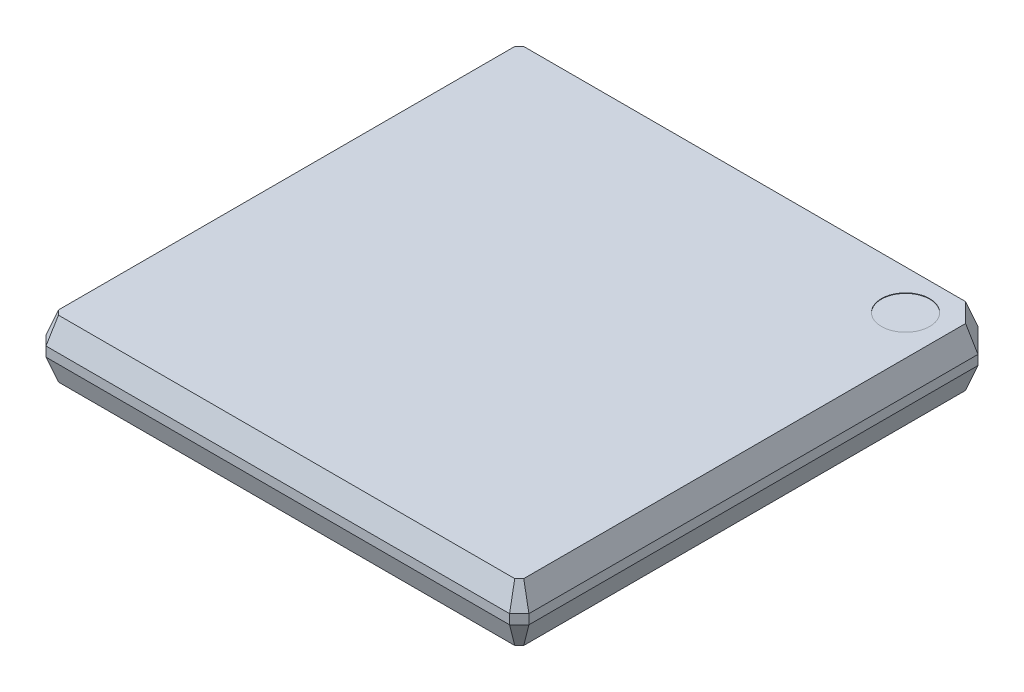
ISO-10303-21;
HEADER;
FILE_DESCRIPTION(('STEP AP214'),'2;1');
FILE_NAME('part.step','',(''),(''),'','','');
FILE_SCHEMA(('AUTOMOTIVE_DESIGN { 1 0 10303 214 1 1 1 1 }'));
ENDSEC;
DATA;
#1=APPLICATION_CONTEXT('core data for automotive mechanical design processes');
#2=APPLICATION_PROTOCOL_DEFINITION('international standard','automotive_design',2000,#1);
#3=PRODUCT_CONTEXT('',#1,'mechanical');
#4=PRODUCT('Part','Part','',(#3));
#5=PRODUCT_RELATED_PRODUCT_CATEGORY('part','',(#4));
#6=PRODUCT_DEFINITION_FORMATION('','',#4);
#7=PRODUCT_DEFINITION_CONTEXT('part definition',#1,'design');
#8=PRODUCT_DEFINITION('design','',#6,#7);
#9=PRODUCT_DEFINITION_SHAPE('','',#8);
#10=(LENGTH_UNIT() NAMED_UNIT(*) SI_UNIT(.MILLI.,.METRE.));
#11=(NAMED_UNIT(*) PLANE_ANGLE_UNIT() SI_UNIT($,.RADIAN.));
#12=(NAMED_UNIT(*) SI_UNIT($,.STERADIAN.) SOLID_ANGLE_UNIT());
#13=UNCERTAINTY_MEASURE_WITH_UNIT(LENGTH_MEASURE(1.E-05),#10,'distance_accuracy_value','');
#14=(GEOMETRIC_REPRESENTATION_CONTEXT(3) GLOBAL_UNCERTAINTY_ASSIGNED_CONTEXT((#13)) GLOBAL_UNIT_ASSIGNED_CONTEXT((#10,
#11,#12)) REPRESENTATION_CONTEXT('',''));
#15=CARTESIAN_POINT('',(0.,0.,0.));
#16=DIRECTION('',(0.,0.,1.));
#17=DIRECTION('',(1.,0.,0.));
#18=AXIS2_PLACEMENT_3D('',#15,#16,#17);
#19=CARTESIAN_POINT('',(5.,0.1,5.));
#20=DIRECTION('',(-1.,0.,0.));
#21=DIRECTION('',(0.,0.,1.));
#22=AXIS2_PLACEMENT_3D('',#19,#20,#21);
#23=PLANE('',#22);
#24=DIRECTION('',(0.,0.,-1.));
#25=VECTOR('',#24,1.);
#26=CARTESIAN_POINT('',(5.,-0.1,5.));
#27=LINE('',#26,#25);
#28=CARTESIAN_POINT('',(5.,-0.1,4.8));
#29=VERTEX_POINT('',#28);
#30=CARTESIAN_POINT('',(5.,-0.1,-4.5));
#31=VERTEX_POINT('',#30);
#32=EDGE_CURVE('E54',#29,#31,#27,.T.);
#33=ORIENTED_EDGE('',*,*,#32,.T.);
#34=DIRECTION('',(0.,1.,0.));
#35=VECTOR('',#34,1.);
#36=CARTESIAN_POINT('',(5.,0.1,-4.5));
#37=LINE('',#36,#35);
#38=CARTESIAN_POINT('',(5.,0.1,-4.5));
#39=VERTEX_POINT('',#38);
#40=EDGE_CURVE('E43',#31,#39,#37,.T.);
#41=ORIENTED_EDGE('',*,*,#40,.T.);
#42=DIRECTION('',(0.,0.,-1.));
#43=VECTOR('',#42,1.);
#44=CARTESIAN_POINT('',(5.,0.1,5.));
#45=LINE('',#44,#43);
#46=CARTESIAN_POINT('',(5.,0.1,4.8));
#47=VERTEX_POINT('',#46);
#48=EDGE_CURVE('E294',#47,#39,#45,.T.);
#49=ORIENTED_EDGE('',*,*,#48,.F.);
#50=DIRECTION('',(0.,-1.,0.));
#51=VECTOR('',#50,1.);
#52=CARTESIAN_POINT('',(5.,0.1,4.8));
#53=LINE('',#52,#51);
#54=EDGE_CURVE('E185',#47,#29,#53,.T.);
#55=ORIENTED_EDGE('',*,*,#54,.T.);
#56=EDGE_LOOP('',(#33,#41,#49,#55));
#57=FACE_BOUND('',#56,.T.);
#58=ADVANCED_FACE('F35',(#57),#23,.F.);
#59=CARTESIAN_POINT('',(-5.,0.1,-5.));
#60=DIRECTION('',(0.,0.,1.));
#61=DIRECTION('',(1.,0.,0.));
#62=AXIS2_PLACEMENT_3D('',#59,#60,#61);
#63=PLANE('',#62);
#64=DIRECTION('',(-1.,0.,0.));
#65=VECTOR('',#64,1.);
#66=CARTESIAN_POINT('',(-5.,0.1,-5.));
#67=LINE('',#66,#65);
#68=CARTESIAN_POINT('',(4.5,0.1,-5.));
#69=VERTEX_POINT('',#68);
#70=CARTESIAN_POINT('',(-4.8,0.1,-5.));
#71=VERTEX_POINT('',#70);
#72=EDGE_CURVE('E296',#69,#71,#67,.T.);
#73=ORIENTED_EDGE('',*,*,#72,.F.);
#74=DIRECTION('',(0.,-1.,0.));
#75=VECTOR('',#74,1.);
#76=CARTESIAN_POINT('',(4.5,0.1,-5.));
#77=LINE('',#76,#75);
#78=CARTESIAN_POINT('',(4.5,-0.1,-5.));
#79=VERTEX_POINT('',#78);
#80=EDGE_CURVE('E157',#69,#79,#77,.T.);
#81=ORIENTED_EDGE('',*,*,#80,.T.);
#82=DIRECTION('',(-1.,0.,0.));
#83=VECTOR('',#82,1.);
#84=CARTESIAN_POINT('',(-5.,-0.1,-5.));
#85=LINE('',#84,#83);
#86=CARTESIAN_POINT('',(-4.8,-0.1,-5.));
#87=VERTEX_POINT('',#86);
#88=EDGE_CURVE('E162',#79,#87,#85,.T.);
#89=ORIENTED_EDGE('',*,*,#88,.T.);
#90=DIRECTION('',(0.,1.,0.));
#91=VECTOR('',#90,1.);
#92=CARTESIAN_POINT('',(-4.8,0.1,-5.));
#93=LINE('',#92,#91);
#94=EDGE_CURVE('E146',#87,#71,#93,.T.);
#95=ORIENTED_EDGE('',*,*,#94,.T.);
#96=EDGE_LOOP('',(#73,#81,#89,#95));
#97=FACE_BOUND('',#96,.T.);
#98=ADVANCED_FACE('F164',(#97),#63,.F.);
#99=CARTESIAN_POINT('',(-5.,0.1,5.));
#100=DIRECTION('',(1.,0.,0.));
#101=DIRECTION('',(0.,0.,-1.));
#102=AXIS2_PLACEMENT_3D('',#99,#100,#101);
#103=PLANE('',#102);
#104=DIRECTION('',(0.,0.,1.));
#105=VECTOR('',#104,1.);
#106=CARTESIAN_POINT('',(-5.,-0.1,5.));
#107=LINE('',#106,#105);
#108=CARTESIAN_POINT('',(-5.,-0.1,-4.8));
#109=VERTEX_POINT('',#108);
#110=CARTESIAN_POINT('',(-5.,-0.1,4.8));
#111=VERTEX_POINT('',#110);
#112=EDGE_CURVE('E168',#109,#111,#107,.T.);
#113=ORIENTED_EDGE('',*,*,#112,.T.);
#114=DIRECTION('',(0.,1.,0.));
#115=VECTOR('',#114,1.);
#116=CARTESIAN_POINT('',(-5.,0.1,4.8));
#117=LINE('',#116,#115);
#118=CARTESIAN_POINT('',(-5.,0.1,4.8));
#119=VERTEX_POINT('',#118);
#120=EDGE_CURVE('E158',#111,#119,#117,.T.);
#121=ORIENTED_EDGE('',*,*,#120,.T.);
#122=DIRECTION('',(0.,0.,1.));
#123=VECTOR('',#122,1.);
#124=CARTESIAN_POINT('',(-5.,0.1,5.));
#125=LINE('',#124,#123);
#126=CARTESIAN_POINT('',(-5.,0.1,-4.8));
#127=VERTEX_POINT('',#126);
#128=EDGE_CURVE('E300',#127,#119,#125,.T.);
#129=ORIENTED_EDGE('',*,*,#128,.F.);
#130=DIRECTION('',(0.,-1.,0.));
#131=VECTOR('',#130,1.);
#132=CARTESIAN_POINT('',(-5.,0.1,-4.8));
#133=LINE('',#132,#131);
#134=EDGE_CURVE('E208',#127,#109,#133,.T.);
#135=ORIENTED_EDGE('',*,*,#134,.T.);
#136=EDGE_LOOP('',(#113,#121,#129,#135));
#137=FACE_BOUND('',#136,.T.);
#138=ADVANCED_FACE('F341',(#137),#103,.F.);
#139=CARTESIAN_POINT('',(-5.,0.1,5.));
#140=DIRECTION('',(0.,0.,-1.));
#141=DIRECTION('',(-1.,0.,0.));
#142=AXIS2_PLACEMENT_3D('',#139,#140,#141);
#143=PLANE('',#142);
#144=DIRECTION('',(1.,0.,0.));
#145=VECTOR('',#144,1.);
#146=CARTESIAN_POINT('',(-5.,-0.1,5.));
#147=LINE('',#146,#145);
#148=CARTESIAN_POINT('',(-4.8,-0.1,5.));
#149=VERTEX_POINT('',#148);
#150=CARTESIAN_POINT('',(4.8,-0.1,5.));
#151=VERTEX_POINT('',#150);
#152=EDGE_CURVE('E297',#149,#151,#147,.T.);
#153=ORIENTED_EDGE('',*,*,#152,.T.);
#154=DIRECTION('',(0.,1.,0.));
#155=VECTOR('',#154,1.);
#156=CARTESIAN_POINT('',(4.8,0.1,5.));
#157=LINE('',#156,#155);
#158=CARTESIAN_POINT('',(4.8,0.1,5.));
#159=VERTEX_POINT('',#158);
#160=EDGE_CURVE('E199',#151,#159,#157,.T.);
#161=ORIENTED_EDGE('',*,*,#160,.T.);
#162=DIRECTION('',(1.,0.,0.));
#163=VECTOR('',#162,1.);
#164=CARTESIAN_POINT('',(-5.,0.1,5.));
#165=LINE('',#164,#163);
#166=CARTESIAN_POINT('',(-4.8,0.1,5.));
#167=VERTEX_POINT('',#166);
#168=EDGE_CURVE('E190',#167,#159,#165,.T.);
#169=ORIENTED_EDGE('',*,*,#168,.F.);
#170=DIRECTION('',(0.,-1.,0.));
#171=VECTOR('',#170,1.);
#172=CARTESIAN_POINT('',(-4.8,0.1,5.));
#173=LINE('',#172,#171);
#174=EDGE_CURVE('E196',#167,#149,#173,.T.);
#175=ORIENTED_EDGE('',*,*,#174,.T.);
#176=EDGE_LOOP('',(#153,#161,#169,#175));
#177=FACE_BOUND('',#176,.T.);
#178=ADVANCED_FACE('F309',(#177),#143,.F.);
#179=CARTESIAN_POINT('',(5.,0.1,4.8));
#180=DIRECTION('',(-0.707106781186548,0.,-0.707106781186548));
#181=DIRECTION('',(0.,-1.,0.));
#182=AXIS2_PLACEMENT_3D('',#179,#180,#181);
#183=PLANE('',#182);
#184=DIRECTION('',(-0.707106781186548,0.,0.707106781186548));
#185=VECTOR('',#184,1.);
#186=CARTESIAN_POINT('',(5.,0.1,4.8));
#187=LINE('',#186,#185);
#188=EDGE_CURVE('E205',#159,#47,#187,.F.);
#189=ORIENTED_EDGE('',*,*,#188,.F.);
#190=ORIENTED_EDGE('',*,*,#160,.F.);
#191=DIRECTION('',(0.707106781186548,0.,-0.707106781186548));
#192=VECTOR('',#191,1.);
#193=CARTESIAN_POINT('',(4.9,-0.1,4.9));
#194=LINE('',#193,#192);
#195=EDGE_CURVE('E188',#29,#151,#194,.F.);
#196=ORIENTED_EDGE('',*,*,#195,.F.);
#197=ORIENTED_EDGE('',*,*,#54,.F.);
#198=EDGE_LOOP('',(#189,#190,#196,#197));
#199=FACE_BOUND('',#198,.T.);
#200=ADVANCED_FACE('F316',(#199),#183,.F.);
#201=CARTESIAN_POINT('',(-4.8,0.1,5.));
#202=DIRECTION('',(0.707106781186548,0.,-0.707106781186548));
#203=DIRECTION('',(0.,-1.,0.));
#204=AXIS2_PLACEMENT_3D('',#201,#202,#203);
#205=PLANE('',#204);
#206=DIRECTION('',(-0.707106781186548,0.,-0.707106781186548));
#207=VECTOR('',#206,1.);
#208=CARTESIAN_POINT('',(-4.8,0.1,5.));
#209=LINE('',#208,#207);
#210=EDGE_CURVE('E202',#119,#167,#209,.F.);
#211=ORIENTED_EDGE('',*,*,#210,.F.);
#212=ORIENTED_EDGE('',*,*,#120,.F.);
#213=DIRECTION('',(0.707106781186548,0.,0.707106781186548));
#214=VECTOR('',#213,1.);
#215=CARTESIAN_POINT('',(-4.9,-0.1,4.9));
#216=LINE('',#215,#214);
#217=EDGE_CURVE('E184',#149,#111,#216,.F.);
#218=ORIENTED_EDGE('',*,*,#217,.F.);
#219=ORIENTED_EDGE('',*,*,#174,.F.);
#220=EDGE_LOOP('',(#211,#212,#218,#219));
#221=FACE_BOUND('',#220,.T.);
#222=ADVANCED_FACE('F339',(#221),#205,.F.);
#223=CARTESIAN_POINT('',(-5.,0.1,-4.8));
#224=DIRECTION('',(0.707106781186548,0.,0.707106781186548));
#225=DIRECTION('',(0.,-1.,0.));
#226=AXIS2_PLACEMENT_3D('',#223,#224,#225);
#227=PLANE('',#226);
#228=DIRECTION('',(0.707106781186548,0.,-0.707106781186548));
#229=VECTOR('',#228,1.);
#230=CARTESIAN_POINT('',(-5.,0.1,-4.8));
#231=LINE('',#230,#229);
#232=EDGE_CURVE('E154',#71,#127,#231,.F.);
#233=ORIENTED_EDGE('',*,*,#232,.F.);
#234=ORIENTED_EDGE('',*,*,#94,.F.);
#235=DIRECTION('',(-0.707106781186548,0.,0.707106781186548));
#236=VECTOR('',#235,1.);
#237=CARTESIAN_POINT('',(-4.9,-0.1,-4.9));
#238=LINE('',#237,#236);
#239=EDGE_CURVE('E151',#109,#87,#238,.F.);
#240=ORIENTED_EDGE('',*,*,#239,.F.);
#241=ORIENTED_EDGE('',*,*,#134,.F.);
#242=EDGE_LOOP('',(#233,#234,#240,#241));
#243=FACE_BOUND('',#242,.T.);
#244=ADVANCED_FACE('F148',(#243),#227,.F.);
#245=CARTESIAN_POINT('',(4.5,0.1,-5.));
#246=DIRECTION('',(-0.707106781186549,0.,0.707106781186546));
#247=DIRECTION('',(0.,-1.,0.));
#248=AXIS2_PLACEMENT_3D('',#245,#246,#247);
#249=PLANE('',#248);
#250=DIRECTION('',(0.707106781186546,0.,0.707106781186549));
#251=VECTOR('',#250,1.);
#252=CARTESIAN_POINT('',(4.5,0.1,-5.));
#253=LINE('',#252,#251);
#254=EDGE_CURVE('E11',#39,#69,#253,.F.);
#255=ORIENTED_EDGE('',*,*,#254,.F.);
#256=ORIENTED_EDGE('',*,*,#40,.F.);
#257=DIRECTION('',(-0.707106781186546,0.,-0.707106781186549));
#258=VECTOR('',#257,1.);
#259=CARTESIAN_POINT('',(4.75000000000001,-0.1,-4.74999999999999));
#260=LINE('',#259,#258);
#261=EDGE_CURVE('E212',#79,#31,#260,.F.);
#262=ORIENTED_EDGE('',*,*,#261,.F.);
#263=ORIENTED_EDGE('',*,*,#80,.F.);
#264=EDGE_LOOP('',(#255,#256,#262,#263));
#265=FACE_BOUND('',#264,.T.);
#266=ADVANCED_FACE('F37',(#265),#249,.F.);
#267=CARTESIAN_POINT('',(4.5,0.1,-5.));
#268=DIRECTION('',(0.,0.342020143325669,-0.939692620785908));
#269=DIRECTION('',(0.,0.939692620785908,0.342020143325669));
#270=AXIS2_PLACEMENT_3D('',#267,#268,#269);
#271=PLANE('',#270);
#272=ORIENTED_EDGE('',*,*,#72,.T.);
#273=DIRECTION('',(-0.140268762712281,-0.930402317101582,-0.338638749317281));
#274=VECTOR('',#273,1.);
#275=CARTESIAN_POINT('',(-4.8,0.1,-5.));
#276=LINE('',#275,#274);
#277=CARTESIAN_POINT('',(-4.72461929633342,0.6,-4.8180148828669));
#278=VERTEX_POINT('',#277);
#279=EDGE_CURVE('E255',#278,#71,#276,.T.);
#280=ORIENTED_EDGE('',*,*,#279,.F.);
#281=DIRECTION('',(1.,0.,0.));
#282=VECTOR('',#281,1.);
#283=CARTESIAN_POINT('',(4.5,0.6,-4.8180148828669));
#284=LINE('',#283,#282);
#285=CARTESIAN_POINT('',(4.42461929633341,0.6,-4.8180148828669));
#286=VERTEX_POINT('',#285);
#287=EDGE_CURVE('E230',#286,#278,#284,.F.);
#288=ORIENTED_EDGE('',*,*,#287,.F.);
#289=DIRECTION('',(0.140268762712281,-0.930402317101582,-0.338638749317281));
#290=VECTOR('',#289,1.);
#291=CARTESIAN_POINT('',(4.5,0.1,-5.));
#292=LINE('',#291,#290);
#293=EDGE_CURVE('E258',#286,#69,#292,.T.);
#294=ORIENTED_EDGE('',*,*,#293,.T.);
#295=EDGE_LOOP('',(#272,#280,#288,#294));
#296=FACE_BOUND('',#295,.T.);
#297=ADVANCED_FACE('F358',(#296),#271,.T.);
#298=CARTESIAN_POINT('',(-4.8,0.1,-5.));
#299=DIRECTION('',(-0.664463024388675,0.342020143325669,-0.664463024388675));
#300=DIRECTION('',(-0.707106781186547,0.,0.707106781186547));
#301=AXIS2_PLACEMENT_3D('',#298,#299,#300);
#302=PLANE('',#301);
#303=ORIENTED_EDGE('',*,*,#232,.T.);
#304=DIRECTION('',(-0.338638749317281,-0.930402317101582,-0.140268762712281));
#305=VECTOR('',#304,1.);
#306=CARTESIAN_POINT('',(-5.,0.1,-4.8));
#307=LINE('',#306,#305);
#308=CARTESIAN_POINT('',(-4.8180148828669,0.6,-4.72461929633342));
#309=VERTEX_POINT('',#308);
#310=EDGE_CURVE('E257',#309,#127,#307,.T.);
#311=ORIENTED_EDGE('',*,*,#310,.F.);
#312=DIRECTION('',(0.707106781186547,0.,-0.707106781186547));
#313=VECTOR('',#312,1.);
#314=CARTESIAN_POINT('',(-4.67131708960016,0.6,-4.87131708960016));
#315=LINE('',#314,#313);
#316=EDGE_CURVE('E281',#278,#309,#315,.F.);
#317=ORIENTED_EDGE('',*,*,#316,.F.);
#318=ORIENTED_EDGE('',*,*,#279,.T.);
#319=EDGE_LOOP('',(#303,#311,#317,#318));
#320=FACE_BOUND('',#319,.T.);
#321=ADVANCED_FACE('F344',(#320),#302,.T.);
#322=CARTESIAN_POINT('',(-5.,0.1,-4.8));
#323=DIRECTION('',(-0.939692620785908,0.342020143325669,0.));
#324=DIRECTION('',(-0.342020143325669,-0.939692620785908,0.));
#325=AXIS2_PLACEMENT_3D('',#322,#323,#324);
#326=PLANE('',#325);
#327=ORIENTED_EDGE('',*,*,#128,.T.);
#328=DIRECTION('',(-0.338638749317281,-0.930402317101582,0.140268762712281));
#329=VECTOR('',#328,1.);
#330=CARTESIAN_POINT('',(-5.,0.1,4.8));
#331=LINE('',#330,#329);
#332=CARTESIAN_POINT('',(-4.8180148828669,0.6,4.72461929633341));
#333=VERTEX_POINT('',#332);
#334=EDGE_CURVE('E274',#333,#119,#331,.T.);
#335=ORIENTED_EDGE('',*,*,#334,.F.);
#336=DIRECTION('',(0.,0.,-1.));
#337=VECTOR('',#336,1.);
#338=CARTESIAN_POINT('',(-4.8180148828669,0.6,-4.8));
#339=LINE('',#338,#337);
#340=EDGE_CURVE('E283',#309,#333,#339,.F.);
#341=ORIENTED_EDGE('',*,*,#340,.F.);
#342=ORIENTED_EDGE('',*,*,#310,.T.);
#343=EDGE_LOOP('',(#327,#335,#341,#342));
#344=FACE_BOUND('',#343,.T.);
#345=ADVANCED_FACE('F348',(#344),#326,.T.);
#346=CARTESIAN_POINT('',(-5.,0.1,4.8));
#347=DIRECTION('',(-0.664463024388675,0.342020143325669,0.664463024388675));
#348=DIRECTION('',(0.707106781186547,0.,0.707106781186547));
#349=AXIS2_PLACEMENT_3D('',#346,#347,#348);
#350=PLANE('',#349);
#351=ORIENTED_EDGE('',*,*,#210,.T.);
#352=DIRECTION('',(-0.140268762712281,-0.930402317101582,0.338638749317281));
#353=VECTOR('',#352,1.);
#354=CARTESIAN_POINT('',(-4.8,0.1,5.));
#355=LINE('',#354,#353);
#356=CARTESIAN_POINT('',(-4.72461929633341,0.6,4.8180148828669));
#357=VERTEX_POINT('',#356);
#358=EDGE_CURVE('E271',#357,#167,#355,.T.);
#359=ORIENTED_EDGE('',*,*,#358,.F.);
#360=DIRECTION('',(-0.707106781186547,0.,-0.707106781186547));
#361=VECTOR('',#360,1.);
#362=CARTESIAN_POINT('',(-4.87131708960015,0.6,4.67131708960016));
#363=LINE('',#362,#361);
#364=EDGE_CURVE('E285',#333,#357,#363,.F.);
#365=ORIENTED_EDGE('',*,*,#364,.F.);
#366=ORIENTED_EDGE('',*,*,#334,.T.);
#367=EDGE_LOOP('',(#351,#359,#365,#366));
#368=FACE_BOUND('',#367,.T.);
#369=ADVANCED_FACE('F374',(#368),#350,.T.);
#370=CARTESIAN_POINT('',(-4.8,0.1,5.));
#371=DIRECTION('',(0.,0.342020143325669,0.939692620785908));
#372=DIRECTION('',(0.,-0.939692620785908,0.342020143325669));
#373=AXIS2_PLACEMENT_3D('',#370,#371,#372);
#374=PLANE('',#373);
#375=ORIENTED_EDGE('',*,*,#168,.T.);
#376=DIRECTION('',(0.140268762712281,-0.930402317101582,0.338638749317281));
#377=VECTOR('',#376,1.);
#378=CARTESIAN_POINT('',(4.8,0.1,5.));
#379=LINE('',#378,#377);
#380=CARTESIAN_POINT('',(4.72461929633342,0.6,4.8180148828669));
#381=VERTEX_POINT('',#380);
#382=EDGE_CURVE('E268',#381,#159,#379,.T.);
#383=ORIENTED_EDGE('',*,*,#382,.F.);
#384=DIRECTION('',(-1.,0.,0.));
#385=VECTOR('',#384,1.);
#386=CARTESIAN_POINT('',(-4.8,0.6,4.8180148828669));
#387=LINE('',#386,#385);
#388=EDGE_CURVE('E287',#357,#381,#387,.F.);
#389=ORIENTED_EDGE('',*,*,#388,.F.);
#390=ORIENTED_EDGE('',*,*,#358,.T.);
#391=EDGE_LOOP('',(#375,#383,#389,#390));
#392=FACE_BOUND('',#391,.T.);
#393=ADVANCED_FACE('F372',(#392),#374,.T.);
#394=CARTESIAN_POINT('',(4.8,0.1,5.));
#395=DIRECTION('',(0.664463024388675,0.342020143325669,0.664463024388675));
#396=DIRECTION('',(0.707106781186547,0.,-0.707106781186547));
#397=AXIS2_PLACEMENT_3D('',#394,#395,#396);
#398=PLANE('',#397);
#399=ORIENTED_EDGE('',*,*,#188,.T.);
#400=DIRECTION('',(0.338638749317281,-0.930402317101582,0.140268762712281));
#401=VECTOR('',#400,1.);
#402=CARTESIAN_POINT('',(5.,0.1,4.8));
#403=LINE('',#402,#401);
#404=CARTESIAN_POINT('',(4.8180148828669,0.6,4.72461929633341));
#405=VERTEX_POINT('',#404);
#406=EDGE_CURVE('E265',#405,#47,#403,.T.);
#407=ORIENTED_EDGE('',*,*,#406,.F.);
#408=DIRECTION('',(-0.707106781186547,0.,0.707106781186547));
#409=VECTOR('',#408,1.);
#410=CARTESIAN_POINT('',(4.67131708960016,0.6,4.87131708960015));
#411=LINE('',#410,#409);
#412=EDGE_CURVE('E289',#381,#405,#411,.F.);
#413=ORIENTED_EDGE('',*,*,#412,.F.);
#414=ORIENTED_EDGE('',*,*,#382,.T.);
#415=EDGE_LOOP('',(#399,#407,#413,#414));
#416=FACE_BOUND('',#415,.T.);
#417=ADVANCED_FACE('F367',(#416),#398,.T.);
#418=CARTESIAN_POINT('',(5.,0.1,4.8));
#419=DIRECTION('',(0.939692620785908,0.342020143325669,0.));
#420=DIRECTION('',(-0.342020143325669,0.939692620785908,0.));
#421=AXIS2_PLACEMENT_3D('',#418,#419,#420);
#422=PLANE('',#421);
#423=ORIENTED_EDGE('',*,*,#48,.T.);
#424=DIRECTION('',(0.338638749317281,-0.930402317101582,-0.14026876271228));
#425=VECTOR('',#424,1.);
#426=CARTESIAN_POINT('',(5.,0.1,-4.5));
#427=LINE('',#426,#425);
#428=CARTESIAN_POINT('',(4.8180148828669,0.6,-4.42461929633341));
#429=VERTEX_POINT('',#428);
#430=EDGE_CURVE('E261',#429,#39,#427,.T.);
#431=ORIENTED_EDGE('',*,*,#430,.F.);
#432=DIRECTION('',(0.,0.,1.));
#433=VECTOR('',#432,1.);
#434=CARTESIAN_POINT('',(4.8180148828669,0.6,4.8));
#435=LINE('',#434,#433);
#436=EDGE_CURVE('E291',#405,#429,#435,.F.);
#437=ORIENTED_EDGE('',*,*,#436,.F.);
#438=ORIENTED_EDGE('',*,*,#406,.T.);
#439=EDGE_LOOP('',(#423,#431,#437,#438));
#440=FACE_BOUND('',#439,.T.);
#441=ADVANCED_FACE('F364',(#440),#422,.T.);
#442=CARTESIAN_POINT('',(5.,0.1,-4.5));
#443=DIRECTION('',(0.664463024388676,0.342020143325669,-0.664463024388673));
#444=DIRECTION('',(-0.707106781186546,0.,-0.707106781186549));
#445=AXIS2_PLACEMENT_3D('',#442,#443,#444);
#446=PLANE('',#445);
#447=ORIENTED_EDGE('',*,*,#254,.T.);
#448=ORIENTED_EDGE('',*,*,#293,.F.);
#449=DIRECTION('',(0.707106781186546,0.,0.707106781186549));
#450=VECTOR('',#449,1.);
#451=CARTESIAN_POINT('',(4.87131708960016,0.6,-4.37131708960016));
#452=LINE('',#451,#450);
#453=EDGE_CURVE('E262',#429,#286,#452,.F.);
#454=ORIENTED_EDGE('',*,*,#453,.F.);
#455=ORIENTED_EDGE('',*,*,#430,.T.);
#456=EDGE_LOOP('',(#447,#448,#454,#455));
#457=FACE_BOUND('',#456,.T.);
#458=ADVANCED_FACE('F360',(#457),#446,.T.);
#459=CARTESIAN_POINT('',(0.,0.6,0.));
#460=DIRECTION('',(0.,1.,0.));
#461=DIRECTION('',(0.,0.,1.));
#462=AXIS2_PLACEMENT_3D('',#459,#460,#461);
#463=PLANE('',#462);
#464=CARTESIAN_POINT('',(4.,0.6,-4.));
#465=DIRECTION('',(0.,1.,0.));
#466=DIRECTION('',(0.,0.,1.));
#467=AXIS2_PLACEMENT_3D('',#464,#465,#466);
#468=CIRCLE('',#467,0.500000000000001);
#469=CARTESIAN_POINT('',(4.,0.6,-3.5));
#470=VERTEX_POINT('',#469);
#471=EDGE_CURVE('E606',#470,#470,#468,.T.);
#472=ORIENTED_EDGE('',*,*,#471,.F.);
#473=EDGE_LOOP('',(#472));
#474=FACE_BOUND('',#473,.T.);
#475=ORIENTED_EDGE('',*,*,#287,.T.);
#476=ORIENTED_EDGE('',*,*,#316,.T.);
#477=ORIENTED_EDGE('',*,*,#340,.T.);
#478=ORIENTED_EDGE('',*,*,#364,.T.);
#479=ORIENTED_EDGE('',*,*,#388,.T.);
#480=ORIENTED_EDGE('',*,*,#412,.T.);
#481=ORIENTED_EDGE('',*,*,#436,.T.);
#482=ORIENTED_EDGE('',*,*,#453,.T.);
#483=EDGE_LOOP('',(#475,#476,#477,#478,#479,#480,#481,#482));
#484=FACE_BOUND('',#483,.T.);
#485=ADVANCED_FACE('F352',(#474,#484),#463,.T.);
#486=CARTESIAN_POINT('',(4.5,-0.1,-5.));
#487=DIRECTION('',(0.,-0.342020143325669,-0.939692620785908));
#488=DIRECTION('',(0.,0.939692620785908,-0.342020143325669));
#489=AXIS2_PLACEMENT_3D('',#486,#487,#488);
#490=PLANE('',#489);
#491=ORIENTED_EDGE('',*,*,#88,.F.);
#492=DIRECTION('',(0.140268762712281,0.930402317101582,-0.338638749317281));
#493=VECTOR('',#492,1.);
#494=CARTESIAN_POINT('',(4.48608744370983,-0.192281947590352,-4.966412117917));
#495=LINE('',#494,#493);
#496=CARTESIAN_POINT('',(4.42461929633341,-0.6,-4.8180148828669));
#497=VERTEX_POINT('',#496);
#498=EDGE_CURVE('E220',#497,#79,#495,.T.);
#499=ORIENTED_EDGE('',*,*,#498,.F.);
#500=DIRECTION('',(-1.,0.,0.));
#501=VECTOR('',#500,1.);
#502=CARTESIAN_POINT('',(4.5,-0.6,-4.8180148828669));
#503=LINE('',#502,#501);
#504=CARTESIAN_POINT('',(-4.72461929633342,-0.6,-4.8180148828669));
#505=VERTEX_POINT('',#504);
#506=EDGE_CURVE('E174',#497,#505,#503,.T.);
#507=ORIENTED_EDGE('',*,*,#506,.T.);
#508=DIRECTION('',(-0.140268762712281,0.930402317101582,-0.338638749317281));
#509=VECTOR('',#508,1.);
#510=CARTESIAN_POINT('',(-4.61701947012665,-1.31370935115364,-4.55824592312953));
#511=LINE('',#510,#509);
#512=EDGE_CURVE('E171',#505,#87,#511,.T.);
#513=ORIENTED_EDGE('',*,*,#512,.T.);
#514=EDGE_LOOP('',(#491,#499,#507,#513));
#515=FACE_BOUND('',#514,.T.);
#516=ADVANCED_FACE('F172',(#515),#490,.T.);
#517=CARTESIAN_POINT('',(5.,-0.1,-4.5));
#518=DIRECTION('',(0.664463024388676,-0.342020143325669,-0.664463024388673));
#519=DIRECTION('',(-0.707106781186546,0.,-0.707106781186549));
#520=AXIS2_PLACEMENT_3D('',#517,#518,#519);
#521=PLANE('',#520);
#522=ORIENTED_EDGE('',*,*,#261,.T.);
#523=DIRECTION('',(0.338638749317281,0.930402317101582,-0.14026876271228));
#524=VECTOR('',#523,1.);
#525=CARTESIAN_POINT('',(4.55824592312953,-1.31370935115364,-4.31701947012664));
#526=LINE('',#525,#524);
#527=CARTESIAN_POINT('',(4.8180148828669,-0.6,-4.42461929633341));
#528=VERTEX_POINT('',#527);
#529=EDGE_CURVE('E218',#528,#31,#526,.T.);
#530=ORIENTED_EDGE('',*,*,#529,.F.);
#531=DIRECTION('',(-0.707106781186546,0.,-0.707106781186549));
#532=VECTOR('',#531,1.);
#533=CARTESIAN_POINT('',(4.87131708960016,-0.6,-4.37131708960016));
#534=LINE('',#533,#532);
#535=EDGE_CURVE('E238',#528,#497,#534,.T.);
#536=ORIENTED_EDGE('',*,*,#535,.T.);
#537=ORIENTED_EDGE('',*,*,#498,.T.);
#538=EDGE_LOOP('',(#522,#530,#536,#537));
#539=FACE_BOUND('',#538,.T.);
#540=ADVANCED_FACE('F215',(#539),#521,.T.);
#541=CARTESIAN_POINT('',(5.,-0.1,4.8));
#542=DIRECTION('',(0.939692620785908,-0.342020143325669,0.));
#543=DIRECTION('',(0.342020143325669,0.939692620785908,0.));
#544=AXIS2_PLACEMENT_3D('',#541,#542,#543);
#545=PLANE('',#544);
#546=ORIENTED_EDGE('',*,*,#32,.F.);
#547=DIRECTION('',(0.338638749317281,0.930402317101582,0.140268762712281));
#548=VECTOR('',#547,1.);
#549=CARTESIAN_POINT('',(4.9865648471668,-0.13691277903614,4.79443497748393));
#550=LINE('',#549,#548);
#551=CARTESIAN_POINT('',(4.8180148828669,-0.6,4.72461929633341));
#552=VERTEX_POINT('',#551);
#553=EDGE_CURVE('E228',#552,#29,#550,.T.);
#554=ORIENTED_EDGE('',*,*,#553,.F.);
#555=DIRECTION('',(0.,0.,-1.));
#556=VECTOR('',#555,1.);
#557=CARTESIAN_POINT('',(4.8180148828669,-0.6,4.8));
#558=LINE('',#557,#556);
#559=EDGE_CURVE('E227',#552,#528,#558,.T.);
#560=ORIENTED_EDGE('',*,*,#559,.T.);
#561=ORIENTED_EDGE('',*,*,#529,.T.);
#562=EDGE_LOOP('',(#546,#554,#560,#561));
#563=FACE_BOUND('',#562,.T.);
#564=ADVANCED_FACE('F225',(#563),#545,.T.);
#565=CARTESIAN_POINT('',(4.8,-0.1,5.));
#566=DIRECTION('',(0.664463024388675,-0.342020143325669,0.664463024388675));
#567=DIRECTION('',(0.707106781186547,0.,-0.707106781186547));
#568=AXIS2_PLACEMENT_3D('',#565,#566,#567);
#569=PLANE('',#568);
#570=ORIENTED_EDGE('',*,*,#195,.T.);
#571=DIRECTION('',(0.140268762712281,0.930402317101582,0.338638749317281));
#572=VECTOR('',#571,1.);
#573=CARTESIAN_POINT('',(4.61111687238879,-1.35286126570699,4.54399579161757));
#574=LINE('',#573,#572);
#575=CARTESIAN_POINT('',(4.72461929633342,-0.6,4.8180148828669));
#576=VERTEX_POINT('',#575);
#577=EDGE_CURVE('E233',#576,#151,#574,.T.);
#578=ORIENTED_EDGE('',*,*,#577,.F.);
#579=DIRECTION('',(0.707106781186547,0.,-0.707106781186547));
#580=VECTOR('',#579,1.);
#581=CARTESIAN_POINT('',(4.67131708960016,-0.6,4.87131708960015));
#582=LINE('',#581,#580);
#583=EDGE_CURVE('E242',#576,#552,#582,.T.);
#584=ORIENTED_EDGE('',*,*,#583,.T.);
#585=ORIENTED_EDGE('',*,*,#553,.T.);
#586=EDGE_LOOP('',(#570,#578,#584,#585));
#587=FACE_BOUND('',#586,.T.);
#588=ADVANCED_FACE('F322',(#587),#569,.T.);
#589=CARTESIAN_POINT('',(-4.8,-0.1,5.));
#590=DIRECTION('',(0.,-0.342020143325669,0.939692620785908));
#591=DIRECTION('',(0.,-0.939692620785908,-0.342020143325669));
#592=AXIS2_PLACEMENT_3D('',#589,#590,#591);
#593=PLANE('',#592);
#594=ORIENTED_EDGE('',*,*,#152,.F.);
#595=DIRECTION('',(-0.140268762712281,0.930402317101582,0.338638749317281));
#596=VECTOR('',#595,1.);
#597=CARTESIAN_POINT('',(-4.79443497748393,-0.13691277903614,4.9865648471668));
#598=LINE('',#597,#596);
#599=CARTESIAN_POINT('',(-4.72461929633341,-0.6,4.8180148828669));
#600=VERTEX_POINT('',#599);
#601=EDGE_CURVE('E321',#600,#149,#598,.T.);
#602=ORIENTED_EDGE('',*,*,#601,.F.);
#603=DIRECTION('',(1.,0.,0.));
#604=VECTOR('',#603,1.);
#605=CARTESIAN_POINT('',(-4.8,-0.6,4.8180148828669));
#606=LINE('',#605,#604);
#607=EDGE_CURVE('E245',#600,#576,#606,.T.);
#608=ORIENTED_EDGE('',*,*,#607,.T.);
#609=ORIENTED_EDGE('',*,*,#577,.T.);
#610=EDGE_LOOP('',(#594,#602,#608,#609));
#611=FACE_BOUND('',#610,.T.);
#612=ADVANCED_FACE('F317',(#611),#593,.T.);
#613=CARTESIAN_POINT('',(-5.,-0.1,4.8));
#614=DIRECTION('',(-0.664463024388675,-0.342020143325669,0.664463024388675));
#615=DIRECTION('',(0.707106781186547,0.,0.707106781186547));
#616=AXIS2_PLACEMENT_3D('',#613,#614,#615);
#617=PLANE('',#616);
#618=ORIENTED_EDGE('',*,*,#217,.T.);
#619=DIRECTION('',(-0.338638749317281,0.930402317101582,0.140268762712281));
#620=VECTOR('',#619,1.);
#621=CARTESIAN_POINT('',(-4.54399579161757,-1.35286126570699,4.61111687238879));
#622=LINE('',#621,#620);
#623=CARTESIAN_POINT('',(-4.8180148828669,-0.6,4.72461929633341));
#624=VERTEX_POINT('',#623);
#625=EDGE_CURVE('E330',#624,#111,#622,.T.);
#626=ORIENTED_EDGE('',*,*,#625,.F.);
#627=DIRECTION('',(0.707106781186547,0.,0.707106781186547));
#628=VECTOR('',#627,1.);
#629=CARTESIAN_POINT('',(-4.87131708960015,-0.6,4.67131708960016));
#630=LINE('',#629,#628);
#631=EDGE_CURVE('E248',#624,#600,#630,.T.);
#632=ORIENTED_EDGE('',*,*,#631,.T.);
#633=ORIENTED_EDGE('',*,*,#601,.T.);
#634=EDGE_LOOP('',(#618,#626,#632,#633));
#635=FACE_BOUND('',#634,.T.);
#636=ADVANCED_FACE('F335',(#635),#617,.T.);
#637=CARTESIAN_POINT('',(-5.,-0.1,-4.8));
#638=DIRECTION('',(-0.939692620785908,-0.342020143325669,0.));
#639=DIRECTION('',(0.342020143325669,-0.939692620785908,0.));
#640=AXIS2_PLACEMENT_3D('',#637,#638,#639);
#641=PLANE('',#640);
#642=ORIENTED_EDGE('',*,*,#112,.F.);
#643=DIRECTION('',(-0.338638749317281,0.930402317101582,-0.140268762712281));
#644=VECTOR('',#643,1.);
#645=CARTESIAN_POINT('',(-4.9865648471668,-0.13691277903614,-4.79443497748394));
#646=LINE('',#645,#644);
#647=CARTESIAN_POINT('',(-4.8180148828669,-0.6,-4.72461929633342));
#648=VERTEX_POINT('',#647);
#649=EDGE_CURVE('E178',#648,#109,#646,.T.);
#650=ORIENTED_EDGE('',*,*,#649,.F.);
#651=DIRECTION('',(0.,0.,1.));
#652=VECTOR('',#651,1.);
#653=CARTESIAN_POINT('',(-4.8180148828669,-0.6,-4.8));
#654=LINE('',#653,#652);
#655=EDGE_CURVE('E251',#648,#624,#654,.T.);
#656=ORIENTED_EDGE('',*,*,#655,.T.);
#657=ORIENTED_EDGE('',*,*,#625,.T.);
#658=EDGE_LOOP('',(#642,#650,#656,#657));
#659=FACE_BOUND('',#658,.T.);
#660=ADVANCED_FACE('F329',(#659),#641,.T.);
#661=CARTESIAN_POINT('',(-4.8,-0.1,-5.));
#662=DIRECTION('',(-0.664463024388675,-0.342020143325669,-0.664463024388675));
#663=DIRECTION('',(-0.707106781186547,0.,0.707106781186547));
#664=AXIS2_PLACEMENT_3D('',#661,#662,#663);
#665=PLANE('',#664);
#666=ORIENTED_EDGE('',*,*,#239,.T.);
#667=ORIENTED_EDGE('',*,*,#512,.F.);
#668=DIRECTION('',(-0.707106781186547,0.,0.707106781186547));
#669=VECTOR('',#668,1.);
#670=CARTESIAN_POINT('',(-4.67131708960016,-0.6,-4.87131708960016));
#671=LINE('',#670,#669);
#672=EDGE_CURVE('E179',#505,#648,#671,.T.);
#673=ORIENTED_EDGE('',*,*,#672,.T.);
#674=ORIENTED_EDGE('',*,*,#649,.T.);
#675=EDGE_LOOP('',(#666,#667,#673,#674));
#676=FACE_BOUND('',#675,.T.);
#677=ADVANCED_FACE('F182',(#676),#665,.T.);
#678=CARTESIAN_POINT('',(0.,-0.6,0.));
#679=DIRECTION('',(0.,-1.,0.));
#680=DIRECTION('',(0.,0.,1.));
#681=AXIS2_PLACEMENT_3D('',#678,#679,#680);
#682=PLANE('',#681);
#683=ORIENTED_EDGE('',*,*,#506,.F.);
#684=ORIENTED_EDGE('',*,*,#535,.F.);
#685=ORIENTED_EDGE('',*,*,#559,.F.);
#686=ORIENTED_EDGE('',*,*,#583,.F.);
#687=ORIENTED_EDGE('',*,*,#607,.F.);
#688=ORIENTED_EDGE('',*,*,#631,.F.);
#689=ORIENTED_EDGE('',*,*,#655,.F.);
#690=ORIENTED_EDGE('',*,*,#672,.F.);
#691=EDGE_LOOP('',(#683,#684,#685,#686,#687,#688,#689,#690));
#692=FACE_BOUND('',#691,.T.);
#693=ADVANCED_FACE('F324',(#692),#682,.T.);
#694=CARTESIAN_POINT('',(4.,0.59,-4.));
#695=DIRECTION('',(0.,1.,0.));
#696=DIRECTION('',(0.,0.,1.));
#697=AXIS2_PLACEMENT_3D('',#694,#695,#696);
#698=CYLINDRICAL_SURFACE('',#697,0.500000000000001);
#699=CARTESIAN_POINT('',(4.,0.59,-4.));
#700=DIRECTION('',(0.,1.,0.));
#701=DIRECTION('',(0.,0.,1.));
#702=AXIS2_PLACEMENT_3D('',#699,#700,#701);
#703=CIRCLE('',#702,0.500000000000001);
#704=CARTESIAN_POINT('',(4.,0.59,-3.5));
#705=VERTEX_POINT('',#704);
#706=EDGE_CURVE('E239',#705,#705,#703,.T.);
#707=ORIENTED_EDGE('',*,*,#706,.F.);
#708=EDGE_LOOP('',(#707));
#709=FACE_BOUND('',#708,.T.);
#710=ORIENTED_EDGE('',*,*,#471,.T.);
#711=EDGE_LOOP('',(#710));
#712=FACE_BOUND('',#711,.T.);
#713=ADVANCED_FACE('F486',(#709,#712),#698,.F.);
#714=CARTESIAN_POINT('',(4.,0.59,-4.));
#715=DIRECTION('',(0.,1.,0.));
#716=DIRECTION('',(0.,0.,1.));
#717=AXIS2_PLACEMENT_3D('',#714,#715,#716);
#718=PLANE('',#717);
#719=ORIENTED_EDGE('',*,*,#706,.T.);
#720=EDGE_LOOP('',(#719));
#721=FACE_BOUND('',#720,.T.);
#722=ADVANCED_FACE('F492',(#721),#718,.T.);
#723=CLOSED_SHELL('',(#58,#98,#138,#178,#200,#222,#244,#266,#297,#321,#345,#369,#393,#417,#441,
#458,#485,#516,#540,#564,#588,#612,#636,#660,#677,#693,#713,#722));
#724=MANIFOLD_SOLID_BREP('B2',#723);
#725=ADVANCED_BREP_SHAPE_REPRESENTATION('',(#18,#724),#14);
#726=SHAPE_DEFINITION_REPRESENTATION(#9,#725);
ENDSEC;
END-ISO-10303-21;
